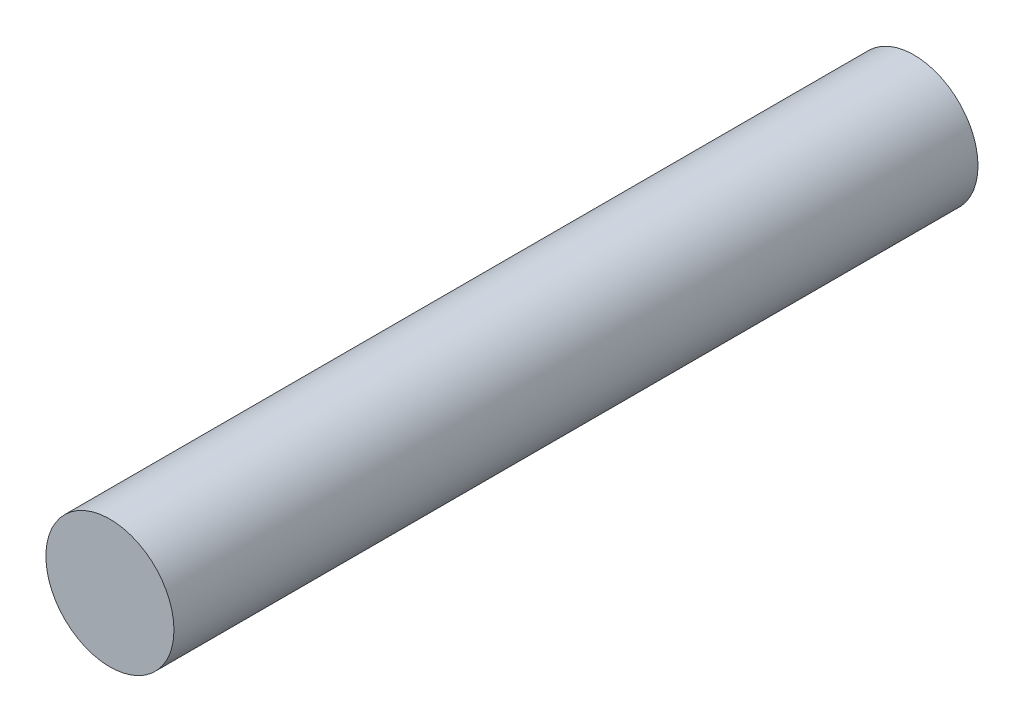
ISO-10303-21;
HEADER;
FILE_DESCRIPTION(('STEP AP214'),'2;1');
FILE_NAME('part.step','',(''),(''),'','','');
FILE_SCHEMA(('AUTOMOTIVE_DESIGN { 1 0 10303 214 1 1 1 1 }'));
ENDSEC;
DATA;
#1=APPLICATION_CONTEXT('core data for automotive mechanical design processes');
#2=APPLICATION_PROTOCOL_DEFINITION('international standard','automotive_design',2000,#1);
#3=PRODUCT_CONTEXT('',#1,'mechanical');
#4=PRODUCT('Part','Part','',(#3));
#5=PRODUCT_RELATED_PRODUCT_CATEGORY('part','',(#4));
#6=PRODUCT_DEFINITION_FORMATION('','',#4);
#7=PRODUCT_DEFINITION_CONTEXT('part definition',#1,'design');
#8=PRODUCT_DEFINITION('design','',#6,#7);
#9=PRODUCT_DEFINITION_SHAPE('','',#8);
#10=(LENGTH_UNIT() NAMED_UNIT(*) SI_UNIT(.MILLI.,.METRE.));
#11=(NAMED_UNIT(*) PLANE_ANGLE_UNIT() SI_UNIT($,.RADIAN.));
#12=(NAMED_UNIT(*) SI_UNIT($,.STERADIAN.) SOLID_ANGLE_UNIT());
#13=UNCERTAINTY_MEASURE_WITH_UNIT(LENGTH_MEASURE(1.E-05),#10,'distance_accuracy_value','');
#14=(GEOMETRIC_REPRESENTATION_CONTEXT(3) GLOBAL_UNCERTAINTY_ASSIGNED_CONTEXT((#13)) GLOBAL_UNIT_ASSIGNED_CONTEXT((#10,
#11,#12)) REPRESENTATION_CONTEXT('',''));
#15=CARTESIAN_POINT('',(0.,0.,0.));
#16=DIRECTION('',(0.,0.,1.));
#17=DIRECTION('',(1.,0.,0.));
#18=AXIS2_PLACEMENT_3D('',#15,#16,#17);
#19=CARTESIAN_POINT('',(0.,0.,152.4));
#20=DIRECTION('',(0.,0.,-1.));
#21=DIRECTION('',(-1.,0.,0.));
#22=AXIS2_PLACEMENT_3D('',#19,#20,#21);
#23=CYLINDRICAL_SURFACE('',#22,4.7625);
#24=CARTESIAN_POINT('',(0.,0.,-37.4));
#25=DIRECTION('',(0.,0.,1.));
#26=DIRECTION('',(-1.,0.,0.));
#27=AXIS2_PLACEMENT_3D('',#24,#25,#26);
#28=CIRCLE('',#27,4.7625);
#29=CARTESIAN_POINT('',(4.7625,0.,-37.4));
#30=VERTEX_POINT('',#29);
#31=EDGE_CURVE('E20',#30,#30,#28,.T.);
#32=ORIENTED_EDGE('',*,*,#31,.T.);
#33=DIRECTION('',(0.,0.,1.));
#34=VECTOR('',#33,1.);
#35=CARTESIAN_POINT('',(4.7625,0.,152.4));
#36=LINE('',#35,#34);
#37=CARTESIAN_POINT('',(4.7625,0.,22.4));
#38=VERTEX_POINT('',#37);
#39=EDGE_CURVE('E11',#30,#38,#36,.T.);
#40=ORIENTED_EDGE('',*,*,#39,.T.);
#41=CARTESIAN_POINT('',(0.,0.,22.4));
#42=DIRECTION('',(0.,0.,-1.));
#43=DIRECTION('',(-1.,0.,0.));
#44=AXIS2_PLACEMENT_3D('',#41,#42,#43);
#45=CIRCLE('',#44,4.7625);
#46=EDGE_CURVE('E27',#38,#38,#45,.T.);
#47=ORIENTED_EDGE('',*,*,#46,.T.);
#48=ORIENTED_EDGE('',*,*,#39,.F.);
#49=EDGE_LOOP('',(#32,#40,#47,#48));
#50=FACE_BOUND('',#49,.T.);
#51=ADVANCED_FACE('F17',(#50),#23,.T.);
#52=CARTESIAN_POINT('',(0.,0.,22.4));
#53=DIRECTION('',(0.,0.,1.));
#54=DIRECTION('',(0.,-1.,0.));
#55=AXIS2_PLACEMENT_3D('',#52,#53,#54);
#56=PLANE('',#55);
#57=ORIENTED_EDGE('',*,*,#46,.F.);
#58=EDGE_LOOP('',(#57));
#59=FACE_BOUND('',#58,.T.);
#60=ADVANCED_FACE('F56',(#59),#56,.T.);
#61=CARTESIAN_POINT('',(0.,0.,-37.4));
#62=DIRECTION('',(0.,0.,-1.));
#63=DIRECTION('',(-1.,0.,0.));
#64=AXIS2_PLACEMENT_3D('',#61,#62,#63);
#65=PLANE('',#64);
#66=ORIENTED_EDGE('',*,*,#31,.F.);
#67=EDGE_LOOP('',(#66));
#68=FACE_BOUND('',#67,.T.);
#69=ADVANCED_FACE('F51',(#68),#65,.T.);
#70=CLOSED_SHELL('',(#51,#60,#69));
#71=MANIFOLD_SOLID_BREP('B1',#70);
#72=ADVANCED_BREP_SHAPE_REPRESENTATION('',(#18,#71),#14);
#73=SHAPE_DEFINITION_REPRESENTATION(#9,#72);
ENDSEC;
END-ISO-10303-21;
